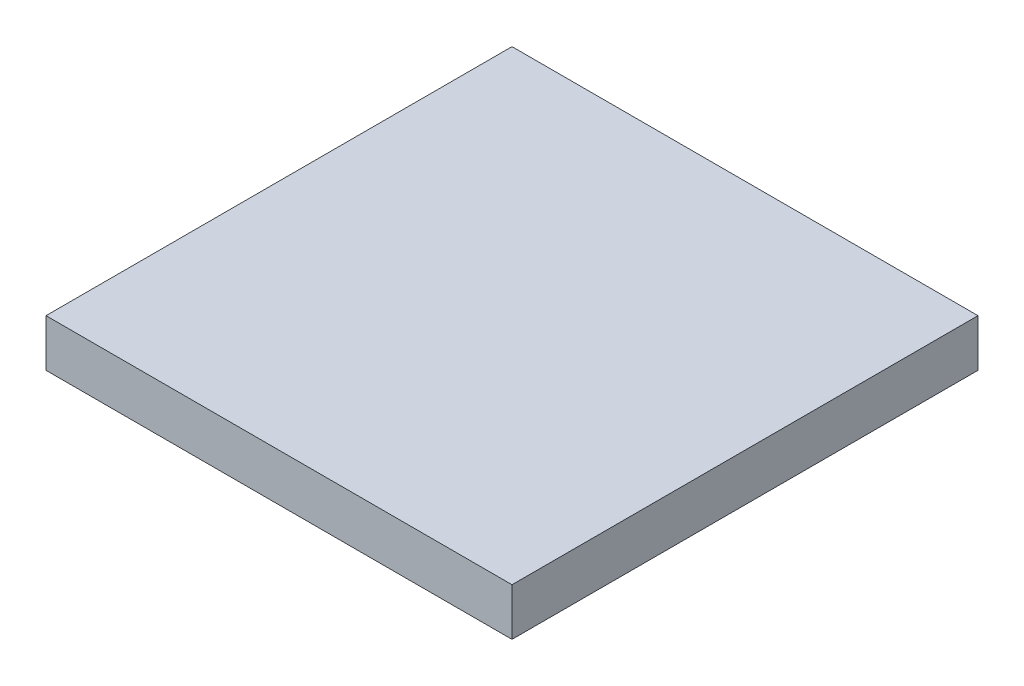
ISO-10303-21;
HEADER;
FILE_DESCRIPTION(('STEP AP214'),'2;1');
FILE_NAME('part.step','',(''),(''),'','','');
FILE_SCHEMA(('AUTOMOTIVE_DESIGN { 1 0 10303 214 1 1 1 1 }'));
ENDSEC;
DATA;
#1=APPLICATION_CONTEXT('core data for automotive mechanical design processes');
#2=APPLICATION_PROTOCOL_DEFINITION('international standard','automotive_design',2000,#1);
#3=PRODUCT_CONTEXT('',#1,'mechanical');
#4=PRODUCT('Part','Part','',(#3));
#5=PRODUCT_RELATED_PRODUCT_CATEGORY('part','',(#4));
#6=PRODUCT_DEFINITION_FORMATION('','',#4);
#7=PRODUCT_DEFINITION_CONTEXT('part definition',#1,'design');
#8=PRODUCT_DEFINITION('design','',#6,#7);
#9=PRODUCT_DEFINITION_SHAPE('','',#8);
#10=(LENGTH_UNIT() NAMED_UNIT(*) SI_UNIT(.MILLI.,.METRE.));
#11=(NAMED_UNIT(*) PLANE_ANGLE_UNIT() SI_UNIT($,.RADIAN.));
#12=(NAMED_UNIT(*) SI_UNIT($,.STERADIAN.) SOLID_ANGLE_UNIT());
#13=UNCERTAINTY_MEASURE_WITH_UNIT(LENGTH_MEASURE(1.E-05),#10,'distance_accuracy_value','');
#14=(GEOMETRIC_REPRESENTATION_CONTEXT(3) GLOBAL_UNCERTAINTY_ASSIGNED_CONTEXT((#13)) GLOBAL_UNIT_ASSIGNED_CONTEXT((#10,
#11,#12)) REPRESENTATION_CONTEXT('',''));
#15=CARTESIAN_POINT('',(0.,0.,0.));
#16=DIRECTION('',(0.,0.,1.));
#17=DIRECTION('',(1.,0.,0.));
#18=AXIS2_PLACEMENT_3D('',#15,#16,#17);
#19=CARTESIAN_POINT('',(-15.5,3.15,-15.5));
#20=DIRECTION('',(1.,0.,0.));
#21=DIRECTION('',(0.,0.,-1.));
#22=AXIS2_PLACEMENT_3D('',#19,#20,#21);
#23=PLANE('',#22);
#24=DIRECTION('',(0.,0.,1.));
#25=VECTOR('',#24,1.);
#26=CARTESIAN_POINT('',(-15.5,0.,-15.5));
#27=LINE('',#26,#25);
#28=CARTESIAN_POINT('',(-15.5,0.,-15.5));
#29=VERTEX_POINT('',#28);
#30=CARTESIAN_POINT('',(-15.5,0.,15.5));
#31=VERTEX_POINT('',#30);
#32=EDGE_CURVE('E96',#29,#31,#27,.T.);
#33=ORIENTED_EDGE('',*,*,#32,.T.);
#34=DIRECTION('',(0.,-1.,0.));
#35=VECTOR('',#34,1.);
#36=CARTESIAN_POINT('',(-15.5,3.15,15.5));
#37=LINE('',#36,#35);
#38=CARTESIAN_POINT('',(-15.5,3.15,15.5));
#39=VERTEX_POINT('',#38);
#40=EDGE_CURVE('E11',#39,#31,#37,.T.);
#41=ORIENTED_EDGE('',*,*,#40,.F.);
#42=DIRECTION('',(0.,0.,1.));
#43=VECTOR('',#42,1.);
#44=CARTESIAN_POINT('',(-15.5,3.15,-15.5));
#45=LINE('',#44,#43);
#46=CARTESIAN_POINT('',(-15.5,3.15,-15.5));
#47=VERTEX_POINT('',#46);
#48=EDGE_CURVE('E84',#47,#39,#45,.T.);
#49=ORIENTED_EDGE('',*,*,#48,.F.);
#50=DIRECTION('',(0.,-1.,0.));
#51=VECTOR('',#50,1.);
#52=CARTESIAN_POINT('',(-15.5,3.15,-15.5));
#53=LINE('',#52,#51);
#54=EDGE_CURVE('E92',#47,#29,#53,.T.);
#55=ORIENTED_EDGE('',*,*,#54,.T.);
#56=EDGE_LOOP('',(#33,#41,#49,#55));
#57=FACE_BOUND('',#56,.T.);
#58=ADVANCED_FACE('F33',(#57),#23,.F.);
#59=CARTESIAN_POINT('',(-15.5,3.15,15.5));
#60=DIRECTION('',(0.,0.,-1.));
#61=DIRECTION('',(-1.,0.,0.));
#62=AXIS2_PLACEMENT_3D('',#59,#60,#61);
#63=PLANE('',#62);
#64=DIRECTION('',(1.,0.,0.));
#65=VECTOR('',#64,1.);
#66=CARTESIAN_POINT('',(-15.5,0.,15.5));
#67=LINE('',#66,#65);
#68=CARTESIAN_POINT('',(15.5,0.,15.5));
#69=VERTEX_POINT('',#68);
#70=EDGE_CURVE('E88',#31,#69,#67,.T.);
#71=ORIENTED_EDGE('',*,*,#70,.T.);
#72=DIRECTION('',(0.,-1.,0.));
#73=VECTOR('',#72,1.);
#74=CARTESIAN_POINT('',(15.5,3.15,15.5));
#75=LINE('',#74,#73);
#76=CARTESIAN_POINT('',(15.5,3.15,15.5));
#77=VERTEX_POINT('',#76);
#78=EDGE_CURVE('E41',#77,#69,#75,.T.);
#79=ORIENTED_EDGE('',*,*,#78,.F.);
#80=DIRECTION('',(1.,0.,0.));
#81=VECTOR('',#80,1.);
#82=CARTESIAN_POINT('',(-15.5,3.15,15.5));
#83=LINE('',#82,#81);
#84=EDGE_CURVE('E79',#39,#77,#83,.T.);
#85=ORIENTED_EDGE('',*,*,#84,.F.);
#86=ORIENTED_EDGE('',*,*,#40,.T.);
#87=EDGE_LOOP('',(#71,#79,#85,#86));
#88=FACE_BOUND('',#87,.T.);
#89=ADVANCED_FACE('F87',(#88),#63,.F.);
#90=CARTESIAN_POINT('',(15.5,3.15,-15.5));
#91=DIRECTION('',(-1.,0.,0.));
#92=DIRECTION('',(0.,0.,1.));
#93=AXIS2_PLACEMENT_3D('',#90,#91,#92);
#94=PLANE('',#93);
#95=DIRECTION('',(0.,0.,-1.));
#96=VECTOR('',#95,1.);
#97=CARTESIAN_POINT('',(15.5,0.,-15.5));
#98=LINE('',#97,#96);
#99=CARTESIAN_POINT('',(15.5,0.,-15.5));
#100=VERTEX_POINT('',#99);
#101=EDGE_CURVE('E66',#69,#100,#98,.T.);
#102=ORIENTED_EDGE('',*,*,#101,.T.);
#103=DIRECTION('',(0.,-1.,0.));
#104=VECTOR('',#103,1.);
#105=CARTESIAN_POINT('',(15.5,3.15,-15.5));
#106=LINE('',#105,#104);
#107=CARTESIAN_POINT('',(15.5,3.15,-15.5));
#108=VERTEX_POINT('',#107);
#109=EDGE_CURVE('E89',#108,#100,#106,.T.);
#110=ORIENTED_EDGE('',*,*,#109,.F.);
#111=DIRECTION('',(0.,0.,-1.));
#112=VECTOR('',#111,1.);
#113=CARTESIAN_POINT('',(15.5,3.15,-15.5));
#114=LINE('',#113,#112);
#115=EDGE_CURVE('E82',#77,#108,#114,.T.);
#116=ORIENTED_EDGE('',*,*,#115,.F.);
#117=ORIENTED_EDGE('',*,*,#78,.T.);
#118=EDGE_LOOP('',(#102,#110,#116,#117));
#119=FACE_BOUND('',#118,.T.);
#120=ADVANCED_FACE('F90',(#119),#94,.F.);
#121=CARTESIAN_POINT('',(-15.5,3.15,-15.5));
#122=DIRECTION('',(0.,0.,1.));
#123=DIRECTION('',(1.,0.,0.));
#124=AXIS2_PLACEMENT_3D('',#121,#122,#123);
#125=PLANE('',#124);
#126=DIRECTION('',(-1.,0.,0.));
#127=VECTOR('',#126,1.);
#128=CARTESIAN_POINT('',(-15.5,0.,-15.5));
#129=LINE('',#128,#127);
#130=EDGE_CURVE('E72',#100,#29,#129,.T.);
#131=ORIENTED_EDGE('',*,*,#130,.T.);
#132=ORIENTED_EDGE('',*,*,#54,.F.);
#133=DIRECTION('',(-1.,0.,0.));
#134=VECTOR('',#133,1.);
#135=CARTESIAN_POINT('',(-15.5,3.15,-15.5));
#136=LINE('',#135,#134);
#137=EDGE_CURVE('E49',#108,#47,#136,.T.);
#138=ORIENTED_EDGE('',*,*,#137,.F.);
#139=ORIENTED_EDGE('',*,*,#109,.T.);
#140=EDGE_LOOP('',(#131,#132,#138,#139));
#141=FACE_BOUND('',#140,.T.);
#142=ADVANCED_FACE('F103',(#141),#125,.F.);
#143=CARTESIAN_POINT('',(-15.5,3.15,15.5));
#144=DIRECTION('',(0.,1.,0.));
#145=DIRECTION('',(0.,0.,1.));
#146=AXIS2_PLACEMENT_3D('',#143,#144,#145);
#147=PLANE('',#146);
#148=ORIENTED_EDGE('',*,*,#48,.T.);
#149=ORIENTED_EDGE('',*,*,#84,.T.);
#150=ORIENTED_EDGE('',*,*,#115,.T.);
#151=ORIENTED_EDGE('',*,*,#137,.T.);
#152=EDGE_LOOP('',(#148,#149,#150,#151));
#153=FACE_BOUND('',#152,.T.);
#154=ADVANCED_FACE('F80',(#153),#147,.T.);
#155=CARTESIAN_POINT('',(-15.5,0.,15.5));
#156=DIRECTION('',(0.,1.,0.));
#157=DIRECTION('',(0.,0.,1.));
#158=AXIS2_PLACEMENT_3D('',#155,#156,#157);
#159=PLANE('',#158);
#160=ORIENTED_EDGE('',*,*,#32,.F.);
#161=ORIENTED_EDGE('',*,*,#130,.F.);
#162=ORIENTED_EDGE('',*,*,#101,.F.);
#163=ORIENTED_EDGE('',*,*,#70,.F.);
#164=EDGE_LOOP('',(#160,#161,#162,#163));
#165=FACE_BOUND('',#164,.T.);
#166=ADVANCED_FACE('F106',(#165),#159,.F.);
#167=CLOSED_SHELL('',(#58,#89,#120,#142,#154,#166));
#168=MANIFOLD_SOLID_BREP('B2',#167);
#169=ADVANCED_BREP_SHAPE_REPRESENTATION('',(#18,#168),#14);
#170=SHAPE_DEFINITION_REPRESENTATION(#9,#169);
ENDSEC;
END-ISO-10303-21;
